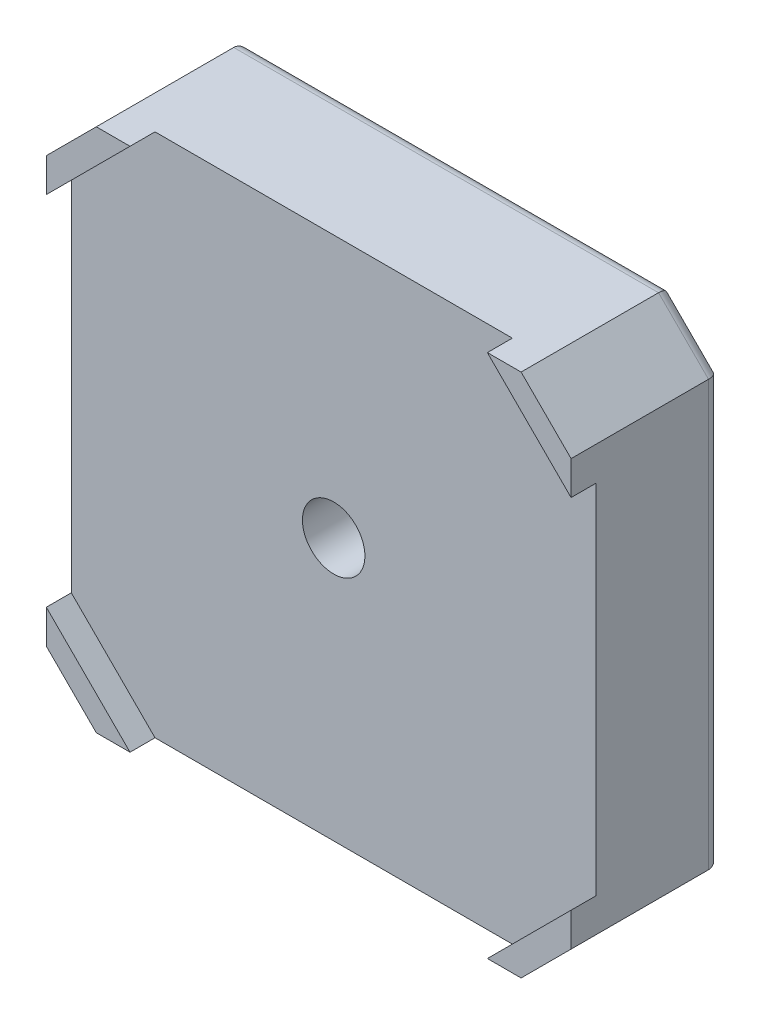
ISO-10303-21;
HEADER;
FILE_DESCRIPTION(('STEP AP214'),'2;1');
FILE_NAME('part.step','',(''),(''),'','','');
FILE_SCHEMA(('AUTOMOTIVE_DESIGN { 1 0 10303 214 1 1 1 1 }'));
ENDSEC;
DATA;
#1=APPLICATION_CONTEXT('core data for automotive mechanical design processes');
#2=APPLICATION_PROTOCOL_DEFINITION('international standard','automotive_design',2000,#1);
#3=PRODUCT_CONTEXT('',#1,'mechanical');
#4=PRODUCT('Part','Part','',(#3));
#5=PRODUCT_RELATED_PRODUCT_CATEGORY('part','',(#4));
#6=PRODUCT_DEFINITION_FORMATION('','',#4);
#7=PRODUCT_DEFINITION_CONTEXT('part definition',#1,'design');
#8=PRODUCT_DEFINITION('design','',#6,#7);
#9=PRODUCT_DEFINITION_SHAPE('','',#8);
#10=(LENGTH_UNIT() NAMED_UNIT(*) SI_UNIT(.MILLI.,.METRE.));
#11=(NAMED_UNIT(*) PLANE_ANGLE_UNIT() SI_UNIT($,.RADIAN.));
#12=(NAMED_UNIT(*) SI_UNIT($,.STERADIAN.) SOLID_ANGLE_UNIT());
#13=UNCERTAINTY_MEASURE_WITH_UNIT(LENGTH_MEASURE(1.E-05),#10,'distance_accuracy_value','');
#14=(GEOMETRIC_REPRESENTATION_CONTEXT(3) GLOBAL_UNCERTAINTY_ASSIGNED_CONTEXT((#13)) GLOBAL_UNIT_ASSIGNED_CONTEXT((#10,
#11,#12)) REPRESENTATION_CONTEXT('',''));
#15=CARTESIAN_POINT('',(0.,0.,0.));
#16=DIRECTION('',(0.,0.,1.));
#17=DIRECTION('',(1.,0.,0.));
#18=AXIS2_PLACEMENT_3D('',#15,#16,#17);
#19=CARTESIAN_POINT('',(0.,0.,12.));
#20=DIRECTION('',(0.,0.,-1.));
#21=DIRECTION('',(-1.,0.,0.));
#22=AXIS2_PLACEMENT_3D('',#19,#20,#21);
#23=PLANE('',#22);
#24=DIRECTION('',(0.,-1.,0.));
#25=VECTOR('',#24,1.);
#26=CARTESIAN_POINT('',(-21.,-17.,12.));
#27=LINE('',#26,#25);
#28=CARTESIAN_POINT('',(-21.,17.,12.));
#29=VERTEX_POINT('',#28);
#30=CARTESIAN_POINT('',(-21.,14.3,12.));
#31=VERTEX_POINT('',#30);
#32=EDGE_CURVE('E265',#29,#31,#27,.T.);
#33=ORIENTED_EDGE('',*,*,#32,.T.);
#34=DIRECTION('',(0.707106781186548,0.707106781186548,0.));
#35=VECTOR('',#34,1.);
#36=CARTESIAN_POINT('',(-17.65,17.65,12.));
#37=LINE('',#36,#35);
#38=CARTESIAN_POINT('',(-14.3,21.,12.));
#39=VERTEX_POINT('',#38);
#40=EDGE_CURVE('E318',#31,#39,#37,.T.);
#41=ORIENTED_EDGE('',*,*,#40,.T.);
#42=DIRECTION('',(-1.,0.,0.));
#43=VECTOR('',#42,1.);
#44=CARTESIAN_POINT('',(-17.,21.,12.));
#45=LINE('',#44,#43);
#46=CARTESIAN_POINT('',(-17.,21.,12.));
#47=VERTEX_POINT('',#46);
#48=EDGE_CURVE('E282',#39,#47,#45,.T.);
#49=ORIENTED_EDGE('',*,*,#48,.T.);
#50=DIRECTION('',(-0.707106781186548,-0.707106781186548,0.));
#51=VECTOR('',#50,1.);
#52=CARTESIAN_POINT('',(-21.,17.,12.));
#53=LINE('',#52,#51);
#54=EDGE_CURVE('E286',#47,#29,#53,.T.);
#55=ORIENTED_EDGE('',*,*,#54,.T.);
#56=EDGE_LOOP('',(#33,#41,#49,#55));
#57=FACE_BOUND('',#56,.T.);
#58=ADVANCED_FACE('F37',(#57),#23,.F.);
#59=CARTESIAN_POINT('',(17.,21.,12.));
#60=VERTEX_POINT('',#59);
#61=CARTESIAN_POINT('',(14.3,21.,12.));
#62=VERTEX_POINT('',#61);
#63=EDGE_CURVE('E283',#60,#62,#45,.T.);
#64=ORIENTED_EDGE('',*,*,#63,.T.);
#65=DIRECTION('',(0.707106781186548,-0.707106781186548,0.));
#66=VECTOR('',#65,1.);
#67=CARTESIAN_POINT('',(17.65,17.65,12.));
#68=LINE('',#67,#66);
#69=CARTESIAN_POINT('',(21.,14.3,12.));
#70=VERTEX_POINT('',#69);
#71=EDGE_CURVE('E315',#62,#70,#68,.T.);
#72=ORIENTED_EDGE('',*,*,#71,.T.);
#73=DIRECTION('',(0.,1.,0.));
#74=VECTOR('',#73,1.);
#75=CARTESIAN_POINT('',(21.,-17.,12.));
#76=LINE('',#75,#74);
#77=CARTESIAN_POINT('',(21.,17.,12.));
#78=VERTEX_POINT('',#77);
#79=EDGE_CURVE('E276',#70,#78,#76,.T.);
#80=ORIENTED_EDGE('',*,*,#79,.T.);
#81=DIRECTION('',(-0.707106781186548,0.707106781186548,0.));
#82=VECTOR('',#81,1.);
#83=CARTESIAN_POINT('',(17.,21.,12.));
#84=LINE('',#83,#82);
#85=EDGE_CURVE('E280',#78,#60,#84,.T.);
#86=ORIENTED_EDGE('',*,*,#85,.T.);
#87=EDGE_LOOP('',(#64,#72,#80,#86));
#88=FACE_BOUND('',#87,.T.);
#89=ADVANCED_FACE('F431',(#88),#23,.F.);
#90=CARTESIAN_POINT('',(21.,-17.,12.));
#91=VERTEX_POINT('',#90);
#92=CARTESIAN_POINT('',(21.,-14.3,12.));
#93=VERTEX_POINT('',#92);
#94=EDGE_CURVE('E277',#91,#93,#76,.T.);
#95=ORIENTED_EDGE('',*,*,#94,.T.);
#96=DIRECTION('',(-0.707106781186548,-0.707106781186548,0.));
#97=VECTOR('',#96,1.);
#98=CARTESIAN_POINT('',(17.65,-17.65,12.));
#99=LINE('',#98,#97);
#100=CARTESIAN_POINT('',(14.3,-21.,12.));
#101=VERTEX_POINT('',#100);
#102=EDGE_CURVE('E312',#93,#101,#99,.T.);
#103=ORIENTED_EDGE('',*,*,#102,.T.);
#104=DIRECTION('',(1.,0.,0.));
#105=VECTOR('',#104,1.);
#106=CARTESIAN_POINT('',(-17.,-21.,12.));
#107=LINE('',#106,#105);
#108=CARTESIAN_POINT('',(17.,-21.,12.));
#109=VERTEX_POINT('',#108);
#110=EDGE_CURVE('E270',#101,#109,#107,.T.);
#111=ORIENTED_EDGE('',*,*,#110,.T.);
#112=DIRECTION('',(0.707106781186547,0.707106781186548,0.));
#113=VECTOR('',#112,1.);
#114=CARTESIAN_POINT('',(17.,-21.,12.));
#115=LINE('',#114,#113);
#116=EDGE_CURVE('E274',#109,#91,#115,.T.);
#117=ORIENTED_EDGE('',*,*,#116,.T.);
#118=EDGE_LOOP('',(#95,#103,#111,#117));
#119=FACE_BOUND('',#118,.T.);
#120=ADVANCED_FACE('F438',(#119),#23,.F.);
#121=CARTESIAN_POINT('',(-21.,-17.,12.));
#122=DIRECTION('',(1.,0.,0.));
#123=DIRECTION('',(0.,0.,-1.));
#124=AXIS2_PLACEMENT_3D('',#121,#122,#123);
#125=PLANE('',#124);
#126=DIRECTION('',(0.,0.,-1.));
#127=VECTOR('',#126,1.);
#128=CARTESIAN_POINT('',(-21.,17.,12.));
#129=LINE('',#128,#127);
#130=CARTESIAN_POINT('',(-21.,17.,1.));
#131=VERTEX_POINT('',#130);
#132=EDGE_CURVE('E288',#29,#131,#129,.T.);
#133=ORIENTED_EDGE('',*,*,#132,.T.);
#134=DIRECTION('',(0.,-1.,0.));
#135=VECTOR('',#134,1.);
#136=CARTESIAN_POINT('',(-21.,-17.,1.));
#137=LINE('',#136,#135);
#138=CARTESIAN_POINT('',(-21.,-17.,1.));
#139=VERTEX_POINT('',#138);
#140=EDGE_CURVE('E344',#131,#139,#137,.T.);
#141=ORIENTED_EDGE('',*,*,#140,.T.);
#142=DIRECTION('',(0.,0.,-1.));
#143=VECTOR('',#142,1.);
#144=CARTESIAN_POINT('',(-21.,-17.,12.));
#145=LINE('',#144,#143);
#146=CARTESIAN_POINT('',(-21.,-17.,12.));
#147=VERTEX_POINT('',#146);
#148=EDGE_CURVE('E306',#147,#139,#145,.T.);
#149=ORIENTED_EDGE('',*,*,#148,.F.);
#150=CARTESIAN_POINT('',(-21.,-14.3,12.));
#151=VERTEX_POINT('',#150);
#152=EDGE_CURVE('E264',#151,#147,#27,.T.);
#153=ORIENTED_EDGE('',*,*,#152,.F.);
#154=DIRECTION('',(0.,0.,-1.));
#155=VECTOR('',#154,1.);
#156=CARTESIAN_POINT('',(-21.,-14.3,12.));
#157=LINE('',#156,#155);
#158=CARTESIAN_POINT('',(-21.,-14.3,10.));
#159=VERTEX_POINT('',#158);
#160=EDGE_CURVE('E234',#151,#159,#157,.T.);
#161=ORIENTED_EDGE('',*,*,#160,.T.);
#162=DIRECTION('',(0.,1.,0.));
#163=VECTOR('',#162,1.);
#164=CARTESIAN_POINT('',(-21.,-17.,10.));
#165=LINE('',#164,#163);
#166=CARTESIAN_POINT('',(-21.,14.3,10.));
#167=VERTEX_POINT('',#166);
#168=EDGE_CURVE('E261',#159,#167,#165,.T.);
#169=ORIENTED_EDGE('',*,*,#168,.T.);
#170=DIRECTION('',(0.,0.,1.));
#171=VECTOR('',#170,1.);
#172=CARTESIAN_POINT('',(-21.,14.3,12.));
#173=LINE('',#172,#171);
#174=EDGE_CURVE('E252',#167,#31,#173,.T.);
#175=ORIENTED_EDGE('',*,*,#174,.T.);
#176=ORIENTED_EDGE('',*,*,#32,.F.);
#177=EDGE_LOOP('',(#133,#141,#149,#153,#161,#169,#175,#176));
#178=FACE_BOUND('',#177,.T.);
#179=ADVANCED_FACE('F457',(#178),#125,.F.);
#180=CARTESIAN_POINT('',(-21.,-17.,12.));
#181=DIRECTION('',(0.707106781186547,0.707106781186547,0.));
#182=DIRECTION('',(-0.707106781186548,0.707106781186548,0.));
#183=AXIS2_PLACEMENT_3D('',#180,#181,#182);
#184=PLANE('',#183);
#185=ORIENTED_EDGE('',*,*,#148,.T.);
#186=DIRECTION('',(0.707106781186548,-0.707106781186548,0.));
#187=VECTOR('',#186,1.);
#188=CARTESIAN_POINT('',(-17.,-21.,1.));
#189=LINE('',#188,#187);
#190=CARTESIAN_POINT('',(-17.,-21.,1.));
#191=VERTEX_POINT('',#190);
#192=EDGE_CURVE('E346',#139,#191,#189,.T.);
#193=ORIENTED_EDGE('',*,*,#192,.T.);
#194=DIRECTION('',(0.,0.,-1.));
#195=VECTOR('',#194,1.);
#196=CARTESIAN_POINT('',(-17.,-21.,12.));
#197=LINE('',#196,#195);
#198=CARTESIAN_POINT('',(-17.,-21.,12.));
#199=VERTEX_POINT('',#198);
#200=EDGE_CURVE('E303',#199,#191,#197,.T.);
#201=ORIENTED_EDGE('',*,*,#200,.F.);
#202=DIRECTION('',(0.707106781186548,-0.707106781186548,0.));
#203=VECTOR('',#202,1.);
#204=CARTESIAN_POINT('',(-21.,-17.,12.));
#205=LINE('',#204,#203);
#206=EDGE_CURVE('E268',#147,#199,#205,.T.);
#207=ORIENTED_EDGE('',*,*,#206,.F.);
#208=EDGE_LOOP('',(#185,#193,#201,#207));
#209=FACE_BOUND('',#208,.T.);
#210=ADVANCED_FACE('F462',(#209),#184,.F.);
#211=CARTESIAN_POINT('',(-17.,-21.,12.));
#212=DIRECTION('',(0.,1.,0.));
#213=DIRECTION('',(0.,0.,1.));
#214=AXIS2_PLACEMENT_3D('',#211,#212,#213);
#215=PLANE('',#214);
#216=ORIENTED_EDGE('',*,*,#200,.T.);
#217=DIRECTION('',(1.,0.,0.));
#218=VECTOR('',#217,1.);
#219=CARTESIAN_POINT('',(17.,-21.,1.));
#220=LINE('',#219,#218);
#221=CARTESIAN_POINT('',(17.,-21.,1.));
#222=VERTEX_POINT('',#221);
#223=EDGE_CURVE('E348',#191,#222,#220,.T.);
#224=ORIENTED_EDGE('',*,*,#223,.T.);
#225=DIRECTION('',(0.,0.,-1.));
#226=VECTOR('',#225,1.);
#227=CARTESIAN_POINT('',(17.,-21.,12.));
#228=LINE('',#227,#226);
#229=EDGE_CURVE('E300',#109,#222,#228,.T.);
#230=ORIENTED_EDGE('',*,*,#229,.F.);
#231=ORIENTED_EDGE('',*,*,#110,.F.);
#232=DIRECTION('',(0.,0.,-1.));
#233=VECTOR('',#232,1.);
#234=CARTESIAN_POINT('',(14.3,-21.,12.));
#235=LINE('',#234,#233);
#236=CARTESIAN_POINT('',(14.3,-21.,10.));
#237=VERTEX_POINT('',#236);
#238=EDGE_CURVE('E240',#101,#237,#235,.T.);
#239=ORIENTED_EDGE('',*,*,#238,.T.);
#240=DIRECTION('',(-1.,0.,0.));
#241=VECTOR('',#240,1.);
#242=CARTESIAN_POINT('',(-17.,-21.,10.));
#243=LINE('',#242,#241);
#244=CARTESIAN_POINT('',(-14.3,-21.,10.));
#245=VERTEX_POINT('',#244);
#246=EDGE_CURVE('E258',#237,#245,#243,.T.);
#247=ORIENTED_EDGE('',*,*,#246,.T.);
#248=DIRECTION('',(0.,0.,1.));
#249=VECTOR('',#248,1.);
#250=CARTESIAN_POINT('',(-14.3,-21.,12.));
#251=LINE('',#250,#249);
#252=CARTESIAN_POINT('',(-14.3,-21.,12.));
#253=VERTEX_POINT('',#252);
#254=EDGE_CURVE('E231',#245,#253,#251,.T.);
#255=ORIENTED_EDGE('',*,*,#254,.T.);
#256=EDGE_CURVE('E271',#199,#253,#107,.T.);
#257=ORIENTED_EDGE('',*,*,#256,.F.);
#258=EDGE_LOOP('',(#216,#224,#230,#231,#239,#247,#255,#257));
#259=FACE_BOUND('',#258,.T.);
#260=ADVANCED_FACE('F478',(#259),#215,.F.);
#261=CARTESIAN_POINT('',(17.,-21.,12.));
#262=DIRECTION('',(-0.707106781186548,0.707106781186547,0.));
#263=DIRECTION('',(-0.707106781186547,-0.707106781186548,0.));
#264=AXIS2_PLACEMENT_3D('',#261,#262,#263);
#265=PLANE('',#264);
#266=ORIENTED_EDGE('',*,*,#229,.T.);
#267=DIRECTION('',(0.707106781186547,0.707106781186548,0.));
#268=VECTOR('',#267,1.);
#269=CARTESIAN_POINT('',(21.,-17.,1.));
#270=LINE('',#269,#268);
#271=CARTESIAN_POINT('',(21.,-17.,1.));
#272=VERTEX_POINT('',#271);
#273=EDGE_CURVE('E350',#222,#272,#270,.T.);
#274=ORIENTED_EDGE('',*,*,#273,.T.);
#275=DIRECTION('',(0.,0.,-1.));
#276=VECTOR('',#275,1.);
#277=CARTESIAN_POINT('',(21.,-17.,12.));
#278=LINE('',#277,#276);
#279=EDGE_CURVE('E298',#91,#272,#278,.T.);
#280=ORIENTED_EDGE('',*,*,#279,.F.);
#281=ORIENTED_EDGE('',*,*,#116,.F.);
#282=EDGE_LOOP('',(#266,#274,#280,#281));
#283=FACE_BOUND('',#282,.T.);
#284=ADVANCED_FACE('F484',(#283),#265,.F.);
#285=CARTESIAN_POINT('',(21.,-17.,12.));
#286=DIRECTION('',(-1.,0.,0.));
#287=DIRECTION('',(0.,-1.,0.));
#288=AXIS2_PLACEMENT_3D('',#285,#286,#287);
#289=PLANE('',#288);
#290=ORIENTED_EDGE('',*,*,#279,.T.);
#291=DIRECTION('',(0.,1.,0.));
#292=VECTOR('',#291,1.);
#293=CARTESIAN_POINT('',(21.,17.,1.));
#294=LINE('',#293,#292);
#295=CARTESIAN_POINT('',(21.,17.,1.));
#296=VERTEX_POINT('',#295);
#297=EDGE_CURVE('E60',#272,#296,#294,.T.);
#298=ORIENTED_EDGE('',*,*,#297,.T.);
#299=DIRECTION('',(0.,0.,-1.));
#300=VECTOR('',#299,1.);
#301=CARTESIAN_POINT('',(21.,17.,12.));
#302=LINE('',#301,#300);
#303=EDGE_CURVE('E296',#78,#296,#302,.T.);
#304=ORIENTED_EDGE('',*,*,#303,.F.);
#305=ORIENTED_EDGE('',*,*,#79,.F.);
#306=DIRECTION('',(0.,0.,-1.));
#307=VECTOR('',#306,1.);
#308=CARTESIAN_POINT('',(21.,14.3,12.));
#309=LINE('',#308,#307);
#310=CARTESIAN_POINT('',(21.,14.3,10.));
#311=VERTEX_POINT('',#310);
#312=EDGE_CURVE('E246',#70,#311,#309,.T.);
#313=ORIENTED_EDGE('',*,*,#312,.T.);
#314=DIRECTION('',(0.,-1.,0.));
#315=VECTOR('',#314,1.);
#316=CARTESIAN_POINT('',(21.,-17.,10.));
#317=LINE('',#316,#315);
#318=CARTESIAN_POINT('',(21.,-14.3,10.));
#319=VERTEX_POINT('',#318);
#320=EDGE_CURVE('E255',#311,#319,#317,.T.);
#321=ORIENTED_EDGE('',*,*,#320,.T.);
#322=DIRECTION('',(0.,0.,1.));
#323=VECTOR('',#322,1.);
#324=CARTESIAN_POINT('',(21.,-14.3,12.));
#325=LINE('',#324,#323);
#326=EDGE_CURVE('E237',#319,#93,#325,.T.);
#327=ORIENTED_EDGE('',*,*,#326,.T.);
#328=ORIENTED_EDGE('',*,*,#94,.F.);
#329=EDGE_LOOP('',(#290,#298,#304,#305,#313,#321,#327,#328));
#330=FACE_BOUND('',#329,.T.);
#331=ADVANCED_FACE('F469',(#330),#289,.F.);
#332=CARTESIAN_POINT('',(17.,21.,12.));
#333=DIRECTION('',(-0.707106781186547,-0.707106781186547,0.));
#334=DIRECTION('',(0.707106781186548,-0.707106781186548,0.));
#335=AXIS2_PLACEMENT_3D('',#332,#333,#334);
#336=PLANE('',#335);
#337=ORIENTED_EDGE('',*,*,#303,.T.);
#338=DIRECTION('',(-0.707106781186548,0.707106781186548,0.));
#339=VECTOR('',#338,1.);
#340=CARTESIAN_POINT('',(17.,21.,1.));
#341=LINE('',#340,#339);
#342=CARTESIAN_POINT('',(17.,21.,1.));
#343=VERTEX_POINT('',#342);
#344=EDGE_CURVE('E52',#296,#343,#341,.T.);
#345=ORIENTED_EDGE('',*,*,#344,.T.);
#346=DIRECTION('',(0.,0.,-1.));
#347=VECTOR('',#346,1.);
#348=CARTESIAN_POINT('',(17.,21.,12.));
#349=LINE('',#348,#347);
#350=EDGE_CURVE('E294',#60,#343,#349,.T.);
#351=ORIENTED_EDGE('',*,*,#350,.F.);
#352=ORIENTED_EDGE('',*,*,#85,.F.);
#353=EDGE_LOOP('',(#337,#345,#351,#352));
#354=FACE_BOUND('',#353,.T.);
#355=ADVANCED_FACE('F901',(#354),#336,.F.);
#356=CARTESIAN_POINT('',(-17.,21.,12.));
#357=DIRECTION('',(0.,-1.,0.));
#358=DIRECTION('',(1.,0.,0.));
#359=AXIS2_PLACEMENT_3D('',#356,#357,#358);
#360=PLANE('',#359);
#361=ORIENTED_EDGE('',*,*,#350,.T.);
#362=DIRECTION('',(-1.,0.,0.));
#363=VECTOR('',#362,1.);
#364=CARTESIAN_POINT('',(-17.,21.,1.));
#365=LINE('',#364,#363);
#366=CARTESIAN_POINT('',(-17.,21.,1.));
#367=VERTEX_POINT('',#366);
#368=EDGE_CURVE('E354',#343,#367,#365,.T.);
#369=ORIENTED_EDGE('',*,*,#368,.T.);
#370=DIRECTION('',(0.,0.,-1.));
#371=VECTOR('',#370,1.);
#372=CARTESIAN_POINT('',(-17.,21.,12.));
#373=LINE('',#372,#371);
#374=EDGE_CURVE('E291',#47,#367,#373,.T.);
#375=ORIENTED_EDGE('',*,*,#374,.F.);
#376=ORIENTED_EDGE('',*,*,#48,.F.);
#377=DIRECTION('',(0.,0.,-1.));
#378=VECTOR('',#377,1.);
#379=CARTESIAN_POINT('',(-14.3,21.,12.));
#380=LINE('',#379,#378);
#381=CARTESIAN_POINT('',(-14.3,21.,10.));
#382=VERTEX_POINT('',#381);
#383=EDGE_CURVE('E249',#39,#382,#380,.T.);
#384=ORIENTED_EDGE('',*,*,#383,.T.);
#385=DIRECTION('',(1.,0.,0.));
#386=VECTOR('',#385,1.);
#387=CARTESIAN_POINT('',(-17.,21.,10.));
#388=LINE('',#387,#386);
#389=CARTESIAN_POINT('',(14.3,21.,10.));
#390=VERTEX_POINT('',#389);
#391=EDGE_CURVE('E218',#382,#390,#388,.T.);
#392=ORIENTED_EDGE('',*,*,#391,.T.);
#393=DIRECTION('',(0.,0.,1.));
#394=VECTOR('',#393,1.);
#395=CARTESIAN_POINT('',(14.3,21.,12.));
#396=LINE('',#395,#394);
#397=EDGE_CURVE('E243',#390,#62,#396,.T.);
#398=ORIENTED_EDGE('',*,*,#397,.T.);
#399=ORIENTED_EDGE('',*,*,#63,.F.);
#400=EDGE_LOOP('',(#361,#369,#375,#376,#384,#392,#398,#399));
#401=FACE_BOUND('',#400,.T.);
#402=ADVANCED_FACE('F453',(#401),#360,.F.);
#403=CARTESIAN_POINT('',(-21.,17.,12.));
#404=DIRECTION('',(0.707106781186547,-0.707106781186547,0.));
#405=DIRECTION('',(0.707106781186548,0.707106781186548,0.));
#406=AXIS2_PLACEMENT_3D('',#403,#404,#405);
#407=PLANE('',#406);
#408=ORIENTED_EDGE('',*,*,#374,.T.);
#409=DIRECTION('',(-0.707106781186548,-0.707106781186548,0.));
#410=VECTOR('',#409,1.);
#411=CARTESIAN_POINT('',(-21.,17.,1.));
#412=LINE('',#411,#410);
#413=EDGE_CURVE('E217',#367,#131,#412,.T.);
#414=ORIENTED_EDGE('',*,*,#413,.T.);
#415=ORIENTED_EDGE('',*,*,#132,.F.);
#416=ORIENTED_EDGE('',*,*,#54,.F.);
#417=EDGE_LOOP('',(#408,#414,#415,#416));
#418=FACE_BOUND('',#417,.T.);
#419=ADVANCED_FACE('F444',(#418),#407,.F.);
#420=ORIENTED_EDGE('',*,*,#256,.T.);
#421=DIRECTION('',(-0.707106781186548,0.707106781186548,0.));
#422=VECTOR('',#421,1.);
#423=CARTESIAN_POINT('',(-17.65,-17.65,12.));
#424=LINE('',#423,#422);
#425=EDGE_CURVE('E309',#253,#151,#424,.T.);
#426=ORIENTED_EDGE('',*,*,#425,.T.);
#427=ORIENTED_EDGE('',*,*,#152,.T.);
#428=ORIENTED_EDGE('',*,*,#206,.T.);
#429=EDGE_LOOP('',(#420,#426,#427,#428));
#430=FACE_BOUND('',#429,.T.);
#431=ADVANCED_FACE('F434',(#430),#23,.F.);
#432=CARTESIAN_POINT('',(0.,0.,0.));
#433=DIRECTION('',(0.,0.,-1.));
#434=DIRECTION('',(-1.,0.,0.));
#435=AXIS2_PLACEMENT_3D('',#432,#433,#434);
#436=PLANE('',#435);
#437=CARTESIAN_POINT('',(15.5,-15.5,0.));
#438=DIRECTION('',(0.,0.,-1.));
#439=DIRECTION('',(-1.,0.,0.));
#440=AXIS2_PLACEMENT_3D('',#437,#438,#439);
#441=CIRCLE('',#440,1.5);
#442=CARTESIAN_POINT('',(14.,-15.5,0.));
#443=VERTEX_POINT('',#442);
#444=EDGE_CURVE('E406',#443,#443,#441,.F.);
#445=ORIENTED_EDGE('',*,*,#444,.T.);
#446=EDGE_LOOP('',(#445));
#447=FACE_BOUND('',#446,.T.);
#448=CARTESIAN_POINT('',(-15.5,-15.5,0.));
#449=DIRECTION('',(0.,0.,-1.));
#450=DIRECTION('',(-1.,0.,0.));
#451=AXIS2_PLACEMENT_3D('',#448,#449,#450);
#452=CIRCLE('',#451,1.5);
#453=CARTESIAN_POINT('',(-17.,-15.5,0.));
#454=VERTEX_POINT('',#453);
#455=EDGE_CURVE('E403',#454,#454,#452,.F.);
#456=ORIENTED_EDGE('',*,*,#455,.T.);
#457=EDGE_LOOP('',(#456));
#458=FACE_BOUND('',#457,.T.);
#459=CARTESIAN_POINT('',(-15.5,15.5,0.));
#460=DIRECTION('',(0.,0.,-1.));
#461=DIRECTION('',(-1.,0.,0.));
#462=AXIS2_PLACEMENT_3D('',#459,#460,#461);
#463=CIRCLE('',#462,1.5);
#464=CARTESIAN_POINT('',(-17.,15.5,0.));
#465=VERTEX_POINT('',#464);
#466=EDGE_CURVE('E400',#465,#465,#463,.F.);
#467=ORIENTED_EDGE('',*,*,#466,.T.);
#468=EDGE_LOOP('',(#467));
#469=FACE_BOUND('',#468,.T.);
#470=CARTESIAN_POINT('',(15.5,15.5,0.));
#471=DIRECTION('',(0.,0.,-1.));
#472=DIRECTION('',(-1.,0.,0.));
#473=AXIS2_PLACEMENT_3D('',#470,#471,#472);
#474=CIRCLE('',#473,1.5);
#475=CARTESIAN_POINT('',(14.,15.5,0.));
#476=VERTEX_POINT('',#475);
#477=EDGE_CURVE('E397',#476,#476,#474,.F.);
#478=ORIENTED_EDGE('',*,*,#477,.T.);
#479=EDGE_LOOP('',(#478));
#480=FACE_BOUND('',#479,.T.);
#481=DIRECTION('',(0.,-1.,0.));
#482=VECTOR('',#481,1.);
#483=CARTESIAN_POINT('',(-20.,17.,0.));
#484=LINE('',#483,#482);
#485=CARTESIAN_POINT('',(-20.,-16.5857864376269,0.));
#486=VERTEX_POINT('',#485);
#487=CARTESIAN_POINT('',(-20.,16.5857864376269,0.));
#488=VERTEX_POINT('',#487);
#489=EDGE_CURVE('E339',#486,#488,#484,.F.);
#490=ORIENTED_EDGE('',*,*,#489,.T.);
#491=DIRECTION('',(-0.707106781186548,-0.707106781186548,0.));
#492=VECTOR('',#491,1.);
#493=CARTESIAN_POINT('',(-16.2928932188135,20.2928932188135,0.));
#494=LINE('',#493,#492);
#495=CARTESIAN_POINT('',(-16.5857864376269,20.,0.));
#496=VERTEX_POINT('',#495);
#497=EDGE_CURVE('E341',#488,#496,#494,.F.);
#498=ORIENTED_EDGE('',*,*,#497,.T.);
#499=DIRECTION('',(-1.,0.,0.));
#500=VECTOR('',#499,1.);
#501=CARTESIAN_POINT('',(17.,20.,0.));
#502=LINE('',#501,#500);
#503=CARTESIAN_POINT('',(16.5857864376269,20.,0.));
#504=VERTEX_POINT('',#503);
#505=EDGE_CURVE('E327',#496,#504,#502,.F.);
#506=ORIENTED_EDGE('',*,*,#505,.T.);
#507=DIRECTION('',(-0.707106781186548,0.707106781186548,0.));
#508=VECTOR('',#507,1.);
#509=CARTESIAN_POINT('',(20.2928932188135,16.2928932188135,0.));
#510=LINE('',#509,#508);
#511=CARTESIAN_POINT('',(20.,16.5857864376269,0.));
#512=VERTEX_POINT('',#511);
#513=EDGE_CURVE('E329',#504,#512,#510,.F.);
#514=ORIENTED_EDGE('',*,*,#513,.T.);
#515=DIRECTION('',(0.,1.,0.));
#516=VECTOR('',#515,1.);
#517=CARTESIAN_POINT('',(20.,-17.,0.));
#518=LINE('',#517,#516);
#519=CARTESIAN_POINT('',(20.,-16.5857864376269,0.));
#520=VERTEX_POINT('',#519);
#521=EDGE_CURVE('E331',#512,#520,#518,.F.);
#522=ORIENTED_EDGE('',*,*,#521,.T.);
#523=DIRECTION('',(0.707106781186547,0.707106781186548,0.));
#524=VECTOR('',#523,1.);
#525=CARTESIAN_POINT('',(16.2928932188135,-20.2928932188135,0.));
#526=LINE('',#525,#524);
#527=CARTESIAN_POINT('',(16.5857864376269,-20.,0.));
#528=VERTEX_POINT('',#527);
#529=EDGE_CURVE('E333',#520,#528,#526,.F.);
#530=ORIENTED_EDGE('',*,*,#529,.T.);
#531=DIRECTION('',(1.,0.,0.));
#532=VECTOR('',#531,1.);
#533=CARTESIAN_POINT('',(-17.,-20.,0.));
#534=LINE('',#533,#532);
#535=CARTESIAN_POINT('',(-16.5857864376269,-20.,0.));
#536=VERTEX_POINT('',#535);
#537=EDGE_CURVE('E335',#528,#536,#534,.F.);
#538=ORIENTED_EDGE('',*,*,#537,.T.);
#539=DIRECTION('',(0.707106781186548,-0.707106781186548,0.));
#540=VECTOR('',#539,1.);
#541=CARTESIAN_POINT('',(-20.2928932188135,-16.2928932188135,0.));
#542=LINE('',#541,#540);
#543=EDGE_CURVE('E337',#536,#486,#542,.F.);
#544=ORIENTED_EDGE('',*,*,#543,.T.);
#545=EDGE_LOOP('',(#490,#498,#506,#514,#522,#530,#538,#544));
#546=FACE_BOUND('',#545,.T.);
#547=CARTESIAN_POINT('',(0.,0.,0.));
#548=DIRECTION('',(0.,0.,-1.));
#549=DIRECTION('',(-1.,0.,0.));
#550=AXIS2_PLACEMENT_3D('',#547,#548,#549);
#551=CIRCLE('',#550,11.);
#552=CARTESIAN_POINT('',(-11.,0.,0.));
#553=VERTEX_POINT('',#552);
#554=EDGE_CURVE('E214',#553,#553,#551,.T.);
#555=ORIENTED_EDGE('',*,*,#554,.F.);
#556=EDGE_LOOP('',(#555));
#557=FACE_BOUND('',#556,.T.);
#558=ADVANCED_FACE('F443',(#447,#458,#469,#480,#546,#557),#436,.T.);
#559=CARTESIAN_POINT('',(0.,0.,10.));
#560=DIRECTION('',(0.,0.,-1.));
#561=DIRECTION('',(-1.,0.,0.));
#562=AXIS2_PLACEMENT_3D('',#559,#560,#561);
#563=PLANE('',#562);
#564=CARTESIAN_POINT('',(0.,0.,10.));
#565=DIRECTION('',(0.,0.,-1.));
#566=DIRECTION('',(-1.,0.,0.));
#567=AXIS2_PLACEMENT_3D('',#564,#565,#566);
#568=CIRCLE('',#567,2.5);
#569=CARTESIAN_POINT('',(-2.5,0.,10.));
#570=VERTEX_POINT('',#569);
#571=EDGE_CURVE('E212',#570,#570,#568,.T.);
#572=ORIENTED_EDGE('',*,*,#571,.T.);
#573=EDGE_LOOP('',(#572));
#574=FACE_BOUND('',#573,.T.);
#575=DIRECTION('',(0.707106781186547,-0.707106781186547,0.));
#576=VECTOR('',#575,1.);
#577=CARTESIAN_POINT('',(-21.15,-14.15,10.));
#578=LINE('',#577,#576);
#579=EDGE_CURVE('E219',#159,#245,#578,.T.);
#580=ORIENTED_EDGE('',*,*,#579,.T.);
#581=ORIENTED_EDGE('',*,*,#246,.F.);
#582=DIRECTION('',(0.707106781186547,0.707106781186547,0.));
#583=VECTOR('',#582,1.);
#584=CARTESIAN_POINT('',(14.15,-21.15,10.));
#585=LINE('',#584,#583);
#586=EDGE_CURVE('E222',#237,#319,#585,.T.);
#587=ORIENTED_EDGE('',*,*,#586,.T.);
#588=ORIENTED_EDGE('',*,*,#320,.F.);
#589=DIRECTION('',(-0.707106781186547,0.707106781186547,0.));
#590=VECTOR('',#589,1.);
#591=CARTESIAN_POINT('',(14.15,21.15,10.));
#592=LINE('',#591,#590);
#593=EDGE_CURVE('E225',#311,#390,#592,.T.);
#594=ORIENTED_EDGE('',*,*,#593,.T.);
#595=ORIENTED_EDGE('',*,*,#391,.F.);
#596=DIRECTION('',(-0.707106781186547,-0.707106781186547,0.));
#597=VECTOR('',#596,1.);
#598=CARTESIAN_POINT('',(-21.15,14.15,10.));
#599=LINE('',#598,#597);
#600=EDGE_CURVE('E228',#382,#167,#599,.T.);
#601=ORIENTED_EDGE('',*,*,#600,.T.);
#602=ORIENTED_EDGE('',*,*,#168,.F.);
#603=EDGE_LOOP('',(#580,#581,#587,#588,#594,#595,#601,#602));
#604=FACE_BOUND('',#603,.T.);
#605=ADVANCED_FACE('F451',(#574,#604),#563,.F.);
#606=CARTESIAN_POINT('',(-21.15,14.15,10.));
#607=DIRECTION('',(-0.707106781186547,0.707106781186547,0.));
#608=DIRECTION('',(-0.707106781186548,-0.707106781186548,0.));
#609=AXIS2_PLACEMENT_3D('',#606,#607,#608);
#610=PLANE('',#609);
#611=ORIENTED_EDGE('',*,*,#600,.F.);
#612=ORIENTED_EDGE('',*,*,#383,.F.);
#613=ORIENTED_EDGE('',*,*,#40,.F.);
#614=ORIENTED_EDGE('',*,*,#174,.F.);
#615=EDGE_LOOP('',(#611,#612,#613,#614));
#616=FACE_BOUND('',#615,.T.);
#617=ADVANCED_FACE('F520',(#616),#610,.F.);
#618=CARTESIAN_POINT('',(14.15,21.15,10.));
#619=DIRECTION('',(0.707106781186547,0.707106781186547,0.));
#620=DIRECTION('',(-0.707106781186548,0.707106781186548,0.));
#621=AXIS2_PLACEMENT_3D('',#618,#619,#620);
#622=PLANE('',#621);
#623=ORIENTED_EDGE('',*,*,#71,.F.);
#624=ORIENTED_EDGE('',*,*,#397,.F.);
#625=ORIENTED_EDGE('',*,*,#593,.F.);
#626=ORIENTED_EDGE('',*,*,#312,.F.);
#627=EDGE_LOOP('',(#623,#624,#625,#626));
#628=FACE_BOUND('',#627,.T.);
#629=ADVANCED_FACE('F638',(#628),#622,.F.);
#630=CARTESIAN_POINT('',(14.15,-21.15,10.));
#631=DIRECTION('',(0.707106781186547,-0.707106781186547,0.));
#632=DIRECTION('',(0.707106781186548,0.707106781186548,0.));
#633=AXIS2_PLACEMENT_3D('',#630,#631,#632);
#634=PLANE('',#633);
#635=ORIENTED_EDGE('',*,*,#102,.F.);
#636=ORIENTED_EDGE('',*,*,#326,.F.);
#637=ORIENTED_EDGE('',*,*,#586,.F.);
#638=ORIENTED_EDGE('',*,*,#238,.F.);
#639=EDGE_LOOP('',(#635,#636,#637,#638));
#640=FACE_BOUND('',#639,.T.);
#641=ADVANCED_FACE('F473',(#640),#634,.F.);
#642=CARTESIAN_POINT('',(-21.15,-14.15,10.));
#643=DIRECTION('',(-0.707106781186547,-0.707106781186547,0.));
#644=DIRECTION('',(0.707106781186548,-0.707106781186548,0.));
#645=AXIS2_PLACEMENT_3D('',#642,#643,#644);
#646=PLANE('',#645);
#647=ORIENTED_EDGE('',*,*,#425,.F.);
#648=ORIENTED_EDGE('',*,*,#254,.F.);
#649=ORIENTED_EDGE('',*,*,#579,.F.);
#650=ORIENTED_EDGE('',*,*,#160,.F.);
#651=EDGE_LOOP('',(#647,#648,#649,#650));
#652=FACE_BOUND('',#651,.T.);
#653=ADVANCED_FACE('F524',(#652),#646,.F.);
#654=CARTESIAN_POINT('',(0.,0.,-2.));
#655=DIRECTION('',(0.,0.,1.));
#656=DIRECTION('',(1.,0.,0.));
#657=AXIS2_PLACEMENT_3D('',#654,#655,#656);
#658=CYLINDRICAL_SURFACE('',#657,11.);
#659=CARTESIAN_POINT('',(0.,0.,-1.5));
#660=DIRECTION('',(0.,0.,-1.));
#661=DIRECTION('',(-1.,0.,0.));
#662=AXIS2_PLACEMENT_3D('',#659,#660,#661);
#663=CIRCLE('',#662,11.);
#664=CARTESIAN_POINT('',(-11.,0.,-1.5));
#665=VERTEX_POINT('',#664);
#666=EDGE_CURVE('E382',#665,#665,#663,.F.);
#667=ORIENTED_EDGE('',*,*,#666,.T.);
#668=EDGE_LOOP('',(#667));
#669=FACE_BOUND('',#668,.T.);
#670=ORIENTED_EDGE('',*,*,#554,.T.);
#671=EDGE_LOOP('',(#670));
#672=FACE_BOUND('',#671,.T.);
#673=ADVANCED_FACE('F628',(#669,#672),#658,.T.);
#674=CARTESIAN_POINT('',(0.,0.,-2.));
#675=DIRECTION('',(0.,0.,-1.));
#676=DIRECTION('',(-1.,0.,0.));
#677=AXIS2_PLACEMENT_3D('',#674,#675,#676);
#678=PLANE('',#677);
#679=CARTESIAN_POINT('',(0.,0.,-2.));
#680=DIRECTION('',(0.,0.,-1.));
#681=DIRECTION('',(-1.,0.,0.));
#682=AXIS2_PLACEMENT_3D('',#679,#680,#681);
#683=CIRCLE('',#682,10.5);
#684=CARTESIAN_POINT('',(-10.5,0.,-2.));
#685=VERTEX_POINT('',#684);
#686=EDGE_CURVE('E379',#685,#685,#683,.T.);
#687=ORIENTED_EDGE('',*,*,#686,.T.);
#688=EDGE_LOOP('',(#687));
#689=FACE_BOUND('',#688,.T.);
#690=CARTESIAN_POINT('',(0.,0.,-2.));
#691=DIRECTION('',(0.,0.,-1.));
#692=DIRECTION('',(-1.,0.,0.));
#693=AXIS2_PLACEMENT_3D('',#690,#691,#692);
#694=CIRCLE('',#693,6.);
#695=CARTESIAN_POINT('',(-6.,0.,-2.));
#696=VERTEX_POINT('',#695);
#697=EDGE_CURVE('E356',#696,#696,#694,.F.);
#698=ORIENTED_EDGE('',*,*,#697,.T.);
#699=EDGE_LOOP('',(#698));
#700=FACE_BOUND('',#699,.T.);
#701=ADVANCED_FACE('F624',(#689,#700),#678,.T.);
#702=CARTESIAN_POINT('',(0.,0.,5.));
#703=DIRECTION('',(0.,0.,-1.));
#704=DIRECTION('',(-1.,0.,0.));
#705=AXIS2_PLACEMENT_3D('',#702,#703,#704);
#706=CYLINDRICAL_SURFACE('',#705,5.5);
#707=CARTESIAN_POINT('',(0.,0.,-1.5));
#708=DIRECTION('',(0.,0.,-1.));
#709=DIRECTION('',(-1.,0.,0.));
#710=AXIS2_PLACEMENT_3D('',#707,#708,#709);
#711=CIRCLE('',#710,5.5);
#712=CARTESIAN_POINT('',(-5.5,0.,-1.5));
#713=VERTEX_POINT('',#712);
#714=EDGE_CURVE('E388',#713,#713,#711,.T.);
#715=ORIENTED_EDGE('',*,*,#714,.T.);
#716=EDGE_LOOP('',(#715));
#717=FACE_BOUND('',#716,.T.);
#718=CARTESIAN_POINT('',(0.,0.,4.5));
#719=DIRECTION('',(0.,0.,-1.));
#720=DIRECTION('',(-1.,0.,0.));
#721=AXIS2_PLACEMENT_3D('',#718,#719,#720);
#722=CIRCLE('',#721,5.5);
#723=CARTESIAN_POINT('',(-5.5,0.,4.5));
#724=VERTEX_POINT('',#723);
#725=EDGE_CURVE('E385',#724,#724,#722,.F.);
#726=ORIENTED_EDGE('',*,*,#725,.T.);
#727=EDGE_LOOP('',(#726));
#728=FACE_BOUND('',#727,.T.);
#729=ADVANCED_FACE('F620',(#717,#728),#706,.F.);
#730=CARTESIAN_POINT('',(0.,0.,5.));
#731=DIRECTION('',(0.,0.,-1.));
#732=DIRECTION('',(-1.,0.,0.));
#733=AXIS2_PLACEMENT_3D('',#730,#731,#732);
#734=PLANE('',#733);
#735=CARTESIAN_POINT('',(0.,0.,5.));
#736=DIRECTION('',(0.,0.,-1.));
#737=DIRECTION('',(-1.,0.,0.));
#738=AXIS2_PLACEMENT_3D('',#735,#736,#737);
#739=CIRCLE('',#738,5.);
#740=CARTESIAN_POINT('',(-5.,0.,5.));
#741=VERTEX_POINT('',#740);
#742=EDGE_CURVE('E391',#741,#741,#739,.T.);
#743=ORIENTED_EDGE('',*,*,#742,.T.);
#744=EDGE_LOOP('',(#743));
#745=FACE_BOUND('',#744,.T.);
#746=CARTESIAN_POINT('',(0.,0.,5.));
#747=DIRECTION('',(0.,0.,-1.));
#748=DIRECTION('',(-1.,0.,0.));
#749=AXIS2_PLACEMENT_3D('',#746,#747,#748);
#750=CIRCLE('',#749,2.5);
#751=CARTESIAN_POINT('',(-2.5,0.,5.));
#752=VERTEX_POINT('',#751);
#753=EDGE_CURVE('E209',#752,#752,#750,.T.);
#754=ORIENTED_EDGE('',*,*,#753,.F.);
#755=EDGE_LOOP('',(#754));
#756=FACE_BOUND('',#755,.T.);
#757=ADVANCED_FACE('F616',(#745,#756),#734,.T.);
#758=CARTESIAN_POINT('',(0.,0.,12.));
#759=DIRECTION('',(0.,0.,-1.));
#760=DIRECTION('',(-1.,0.,0.));
#761=AXIS2_PLACEMENT_3D('',#758,#759,#760);
#762=CYLINDRICAL_SURFACE('',#761,2.5);
#763=ORIENTED_EDGE('',*,*,#753,.T.);
#764=EDGE_LOOP('',(#763));
#765=FACE_BOUND('',#764,.T.);
#766=ORIENTED_EDGE('',*,*,#571,.F.);
#767=EDGE_LOOP('',(#766));
#768=FACE_BOUND('',#767,.T.);
#769=ADVANCED_FACE('F563',(#765,#768),#762,.F.);
#770=CARTESIAN_POINT('',(16.2928932188135,-20.2928932188135,1.));
#771=DIRECTION('',(-0.707106781186547,-0.707106781186548,0.));
#772=DIRECTION('',(0.707106781186548,-0.707106781186547,0.));
#773=AXIS2_PLACEMENT_3D('',#770,#771,#772);
#774=CYLINDRICAL_SURFACE('',#773,1.);
#775=CARTESIAN_POINT('',(16.5857864376269,-20.,1.));
#776=DIRECTION('',(-0.923879532511287,-0.38268343236509,0.));
#777=DIRECTION('',(0.38268343236509,-0.923879532511287,0.));
#778=AXIS2_PLACEMENT_3D('',#775,#776,#777);
#779=ELLIPSE('',#778,1.08239220029239,1.);
#780=EDGE_CURVE('E372',#528,#222,#779,.T.);
#781=ORIENTED_EDGE('',*,*,#780,.F.);
#782=ORIENTED_EDGE('',*,*,#529,.F.);
#783=CARTESIAN_POINT('',(20.,-16.5857864376269,1.));
#784=DIRECTION('',(-0.382683432365089,-0.923879532511287,0.));
#785=DIRECTION('',(0.923879532511287,-0.382683432365089,0.));
#786=AXIS2_PLACEMENT_3D('',#783,#784,#785);
#787=ELLIPSE('',#786,1.08239220029239,1.);
#788=EDGE_CURVE('E213',#272,#520,#787,.F.);
#789=ORIENTED_EDGE('',*,*,#788,.F.);
#790=ORIENTED_EDGE('',*,*,#273,.F.);
#791=EDGE_LOOP('',(#781,#782,#789,#790));
#792=FACE_BOUND('',#791,.T.);
#793=ADVANCED_FACE('F487',(#792),#774,.T.);
#794=CARTESIAN_POINT('',(20.,-17.,1.));
#795=DIRECTION('',(0.,-1.,0.));
#796=DIRECTION('',(1.,0.,0.));
#797=AXIS2_PLACEMENT_3D('',#794,#795,#796);
#798=CYLINDRICAL_SURFACE('',#797,1.);
#799=ORIENTED_EDGE('',*,*,#788,.T.);
#800=ORIENTED_EDGE('',*,*,#521,.F.);
#801=CARTESIAN_POINT('',(20.,16.5857864376269,1.));
#802=DIRECTION('',(0.38268343236509,-0.923879532511287,0.));
#803=DIRECTION('',(0.923879532511287,0.38268343236509,0.));
#804=AXIS2_PLACEMENT_3D('',#801,#802,#803);
#805=ELLIPSE('',#804,1.08239220029239,1.);
#806=EDGE_CURVE('E369',#296,#512,#805,.F.);
#807=ORIENTED_EDGE('',*,*,#806,.F.);
#808=ORIENTED_EDGE('',*,*,#297,.F.);
#809=EDGE_LOOP('',(#799,#800,#807,#808));
#810=FACE_BOUND('',#809,.T.);
#811=ADVANCED_FACE('F499',(#810),#798,.T.);
#812=CARTESIAN_POINT('',(-17.,-20.,1.));
#813=DIRECTION('',(-1.,0.,0.));
#814=DIRECTION('',(0.,0.,1.));
#815=AXIS2_PLACEMENT_3D('',#812,#813,#814);
#816=CYLINDRICAL_SURFACE('',#815,1.);
#817=ORIENTED_EDGE('',*,*,#780,.T.);
#818=ORIENTED_EDGE('',*,*,#223,.F.);
#819=CARTESIAN_POINT('',(-16.5857864376269,-20.,1.));
#820=DIRECTION('',(-0.923879532511287,0.38268343236509,0.));
#821=DIRECTION('',(-0.38268343236509,-0.923879532511287,0.));
#822=AXIS2_PLACEMENT_3D('',#819,#820,#821);
#823=ELLIPSE('',#822,1.08239220029239,1.);
#824=EDGE_CURVE('E366',#536,#191,#823,.T.);
#825=ORIENTED_EDGE('',*,*,#824,.F.);
#826=ORIENTED_EDGE('',*,*,#537,.F.);
#827=EDGE_LOOP('',(#817,#818,#825,#826));
#828=FACE_BOUND('',#827,.T.);
#829=ADVANCED_FACE('F491',(#828),#816,.T.);
#830=CARTESIAN_POINT('',(16.2928932188135,20.2928932188135,1.));
#831=DIRECTION('',(0.707106781186548,-0.707106781186548,0.));
#832=DIRECTION('',(0.707106781186548,0.707106781186548,0.));
#833=AXIS2_PLACEMENT_3D('',#830,#831,#832);
#834=CYLINDRICAL_SURFACE('',#833,1.);
#835=ORIENTED_EDGE('',*,*,#806,.T.);
#836=ORIENTED_EDGE('',*,*,#513,.F.);
#837=CARTESIAN_POINT('',(16.5857864376269,20.,1.));
#838=DIRECTION('',(0.923879532511287,-0.38268343236509,0.));
#839=DIRECTION('',(0.38268343236509,0.923879532511287,0.));
#840=AXIS2_PLACEMENT_3D('',#837,#838,#839);
#841=ELLIPSE('',#840,1.08239220029239,1.);
#842=EDGE_CURVE('E363',#343,#504,#841,.F.);
#843=ORIENTED_EDGE('',*,*,#842,.F.);
#844=ORIENTED_EDGE('',*,*,#344,.F.);
#845=EDGE_LOOP('',(#835,#836,#843,#844));
#846=FACE_BOUND('',#845,.T.);
#847=ADVANCED_FACE('F504',(#846),#834,.T.);
#848=CARTESIAN_POINT('',(-20.2928932188135,-16.2928932188135,1.));
#849=DIRECTION('',(-0.707106781186548,0.707106781186548,0.));
#850=DIRECTION('',(-0.707106781186548,-0.707106781186548,0.));
#851=AXIS2_PLACEMENT_3D('',#848,#849,#850);
#852=CYLINDRICAL_SURFACE('',#851,1.);
#853=ORIENTED_EDGE('',*,*,#824,.T.);
#854=ORIENTED_EDGE('',*,*,#192,.F.);
#855=CARTESIAN_POINT('',(-20.,-16.5857864376269,1.));
#856=DIRECTION('',(-0.38268343236509,0.923879532511287,0.));
#857=DIRECTION('',(-0.923879532511287,-0.38268343236509,0.));
#858=AXIS2_PLACEMENT_3D('',#855,#856,#857);
#859=ELLIPSE('',#858,1.08239220029239,1.);
#860=EDGE_CURVE('E360',#486,#139,#859,.T.);
#861=ORIENTED_EDGE('',*,*,#860,.F.);
#862=ORIENTED_EDGE('',*,*,#543,.F.);
#863=EDGE_LOOP('',(#853,#854,#861,#862));
#864=FACE_BOUND('',#863,.T.);
#865=ADVANCED_FACE('F530',(#864),#852,.T.);
#866=CARTESIAN_POINT('',(-17.,20.,1.));
#867=DIRECTION('',(1.,0.,0.));
#868=DIRECTION('',(0.,1.,0.));
#869=AXIS2_PLACEMENT_3D('',#866,#867,#868);
#870=CYLINDRICAL_SURFACE('',#869,1.);
#871=ORIENTED_EDGE('',*,*,#842,.T.);
#872=ORIENTED_EDGE('',*,*,#505,.F.);
#873=CARTESIAN_POINT('',(-16.5857864376269,20.,1.));
#874=DIRECTION('',(0.923879532511287,0.38268343236509,0.));
#875=DIRECTION('',(0.38268343236509,-0.923879532511287,0.));
#876=AXIS2_PLACEMENT_3D('',#873,#874,#875);
#877=ELLIPSE('',#876,1.08239220029239,1.);
#878=EDGE_CURVE('E358',#367,#496,#877,.F.);
#879=ORIENTED_EDGE('',*,*,#878,.F.);
#880=ORIENTED_EDGE('',*,*,#368,.F.);
#881=EDGE_LOOP('',(#871,#872,#879,#880));
#882=FACE_BOUND('',#881,.T.);
#883=ADVANCED_FACE('F509',(#882),#870,.T.);
#884=CARTESIAN_POINT('',(-20.,-17.,1.));
#885=DIRECTION('',(0.,1.,0.));
#886=DIRECTION('',(0.,0.,1.));
#887=AXIS2_PLACEMENT_3D('',#884,#885,#886);
#888=CYLINDRICAL_SURFACE('',#887,1.);
#889=ORIENTED_EDGE('',*,*,#860,.T.);
#890=ORIENTED_EDGE('',*,*,#140,.F.);
#891=CARTESIAN_POINT('',(-20.,16.5857864376269,1.));
#892=DIRECTION('',(0.38268343236509,0.923879532511287,0.));
#893=DIRECTION('',(-0.923879532511287,0.38268343236509,0.));
#894=AXIS2_PLACEMENT_3D('',#891,#892,#893);
#895=ELLIPSE('',#894,1.08239220029239,1.);
#896=EDGE_CURVE('E208',#488,#131,#895,.T.);
#897=ORIENTED_EDGE('',*,*,#896,.F.);
#898=ORIENTED_EDGE('',*,*,#489,.F.);
#899=EDGE_LOOP('',(#889,#890,#897,#898));
#900=FACE_BOUND('',#899,.T.);
#901=ADVANCED_FACE('F534',(#900),#888,.T.);
#902=CARTESIAN_POINT('',(-20.2928932188135,16.2928932188135,1.));
#903=DIRECTION('',(0.707106781186548,0.707106781186548,0.));
#904=DIRECTION('',(-0.707106781186548,0.707106781186548,0.));
#905=AXIS2_PLACEMENT_3D('',#902,#903,#904);
#906=CYLINDRICAL_SURFACE('',#905,1.);
#907=ORIENTED_EDGE('',*,*,#878,.T.);
#908=ORIENTED_EDGE('',*,*,#497,.F.);
#909=ORIENTED_EDGE('',*,*,#896,.T.);
#910=ORIENTED_EDGE('',*,*,#413,.F.);
#911=EDGE_LOOP('',(#907,#908,#909,#910));
#912=FACE_BOUND('',#911,.T.);
#913=ADVANCED_FACE('F538',(#912),#906,.T.);
#914=CARTESIAN_POINT('',(0.,0.,-1.5));
#915=DIRECTION('',(0.,0.,-1.));
#916=DIRECTION('',(-1.,0.,0.));
#917=AXIS2_PLACEMENT_3D('',#914,#915,#916);
#918=TOROIDAL_SURFACE('',#917,10.5,0.5);
#919=ORIENTED_EDGE('',*,*,#666,.F.);
#920=EDGE_LOOP('',(#919));
#921=FACE_BOUND('',#920,.T.);
#922=ORIENTED_EDGE('',*,*,#686,.F.);
#923=EDGE_LOOP('',(#922));
#924=FACE_BOUND('',#923,.T.);
#925=ADVANCED_FACE('F540',(#921,#924),#918,.T.);
#926=CARTESIAN_POINT('',(0.,0.,-1.5));
#927=DIRECTION('',(0.,0.,-1.));
#928=DIRECTION('',(-1.,0.,0.));
#929=AXIS2_PLACEMENT_3D('',#926,#927,#928);
#930=TOROIDAL_SURFACE('',#929,6.,0.5);
#931=ORIENTED_EDGE('',*,*,#697,.F.);
#932=EDGE_LOOP('',(#931));
#933=FACE_BOUND('',#932,.T.);
#934=ORIENTED_EDGE('',*,*,#714,.F.);
#935=EDGE_LOOP('',(#934));
#936=FACE_BOUND('',#935,.T.);
#937=ADVANCED_FACE('F546',(#933,#936),#930,.T.);
#938=CARTESIAN_POINT('',(0.,0.,4.5));
#939=DIRECTION('',(0.,0.,-1.));
#940=DIRECTION('',(-1.,0.,0.));
#941=AXIS2_PLACEMENT_3D('',#938,#939,#940);
#942=TOROIDAL_SURFACE('',#941,5.,0.5);
#943=ORIENTED_EDGE('',*,*,#725,.F.);
#944=EDGE_LOOP('',(#943));
#945=FACE_BOUND('',#944,.T.);
#946=ORIENTED_EDGE('',*,*,#742,.F.);
#947=EDGE_LOOP('',(#946));
#948=FACE_BOUND('',#947,.T.);
#949=ADVANCED_FACE('F567',(#945,#948),#942,.F.);
#950=CARTESIAN_POINT('',(-15.5,15.5,4.5));
#951=DIRECTION('',(0.,0.,-1.));
#952=DIRECTION('',(-1.,0.,0.));
#953=AXIS2_PLACEMENT_3D('',#950,#951,#952);
#954=CONICAL_SURFACE('',#953,1.25,1.02974425867665);
#955=CARTESIAN_POINT('',(-15.5,15.5,5.25107577378445));
#956=VERTEX_POINT('',#955);
#957=VERTEX_LOOP('',#956);
#958=FACE_BOUND('',#957,.T.);
#959=CARTESIAN_POINT('',(-15.5,15.5,4.5));
#960=DIRECTION('',(0.,0.,-1.));
#961=DIRECTION('',(-1.,0.,0.));
#962=AXIS2_PLACEMENT_3D('',#959,#960,#961);
#963=CIRCLE('',#962,1.25);
#964=CARTESIAN_POINT('',(-16.75,15.5,4.5));
#965=VERTEX_POINT('',#964);
#966=EDGE_CURVE('E205',#965,#965,#963,.T.);
#967=ORIENTED_EDGE('',*,*,#966,.T.);
#968=EDGE_LOOP('',(#967));
#969=FACE_BOUND('',#968,.T.);
#970=ADVANCED_FACE('F571',(#958,#969),#954,.F.);
#971=CARTESIAN_POINT('',(-15.5,15.5,0.));
#972=DIRECTION('',(0.,0.,-1.));
#973=DIRECTION('',(-1.,0.,0.));
#974=AXIS2_PLACEMENT_3D('',#971,#972,#973);
#975=CYLINDRICAL_SURFACE('',#974,1.25);
#976=CARTESIAN_POINT('',(-15.5,15.5,0.25));
#977=DIRECTION('',(0.,0.,-1.));
#978=DIRECTION('',(-1.,0.,0.));
#979=AXIS2_PLACEMENT_3D('',#976,#977,#978);
#980=CIRCLE('',#979,1.25);
#981=CARTESIAN_POINT('',(-16.75,15.5,0.25));
#982=VERTEX_POINT('',#981);
#983=EDGE_CURVE('E45',#982,#982,#980,.T.);
#984=ORIENTED_EDGE('',*,*,#983,.T.);
#985=EDGE_LOOP('',(#984));
#986=FACE_BOUND('',#985,.T.);
#987=ORIENTED_EDGE('',*,*,#966,.F.);
#988=EDGE_LOOP('',(#987));
#989=FACE_BOUND('',#988,.T.);
#990=ADVANCED_FACE('F414',(#986,#989),#975,.F.);
#991=CARTESIAN_POINT('',(15.5,15.5,4.5));
#992=DIRECTION('',(0.,0.,-1.));
#993=DIRECTION('',(-1.,0.,0.));
#994=AXIS2_PLACEMENT_3D('',#991,#992,#993);
#995=CONICAL_SURFACE('',#994,1.25,1.02974425867665);
#996=CARTESIAN_POINT('',(15.5,15.5,5.25107577378445));
#997=VERTEX_POINT('',#996);
#998=VERTEX_LOOP('',#997);
#999=FACE_BOUND('',#998,.T.);
#1000=CARTESIAN_POINT('',(15.5,15.5,4.5));
#1001=DIRECTION('',(0.,0.,-1.));
#1002=DIRECTION('',(-1.,0.,0.));
#1003=AXIS2_PLACEMENT_3D('',#1000,#1001,#1002);
#1004=CIRCLE('',#1003,1.25);
#1005=CARTESIAN_POINT('',(14.25,15.5,4.5));
#1006=VERTEX_POINT('',#1005);
#1007=EDGE_CURVE('E200',#1006,#1006,#1004,.T.);
#1008=ORIENTED_EDGE('',*,*,#1007,.T.);
#1009=EDGE_LOOP('',(#1008));
#1010=FACE_BOUND('',#1009,.T.);
#1011=ADVANCED_FACE('F596',(#999,#1010),#995,.F.);
#1012=CARTESIAN_POINT('',(15.5,15.5,0.));
#1013=DIRECTION('',(0.,0.,-1.));
#1014=DIRECTION('',(-1.,0.,0.));
#1015=AXIS2_PLACEMENT_3D('',#1012,#1013,#1014);
#1016=CYLINDRICAL_SURFACE('',#1015,1.25);
#1017=CARTESIAN_POINT('',(15.5,15.5,0.25));
#1018=DIRECTION('',(0.,0.,-1.));
#1019=DIRECTION('',(-1.,0.,0.));
#1020=AXIS2_PLACEMENT_3D('',#1017,#1018,#1019);
#1021=CIRCLE('',#1020,1.25);
#1022=CARTESIAN_POINT('',(14.25,15.5,0.25));
#1023=VERTEX_POINT('',#1022);
#1024=EDGE_CURVE('E11',#1023,#1023,#1021,.T.);
#1025=ORIENTED_EDGE('',*,*,#1024,.T.);
#1026=EDGE_LOOP('',(#1025));
#1027=FACE_BOUND('',#1026,.T.);
#1028=ORIENTED_EDGE('',*,*,#1007,.F.);
#1029=EDGE_LOOP('',(#1028));
#1030=FACE_BOUND('',#1029,.T.);
#1031=ADVANCED_FACE('F592',(#1027,#1030),#1016,.F.);
#1032=CARTESIAN_POINT('',(-15.5,-15.5,4.5));
#1033=DIRECTION('',(0.,0.,-1.));
#1034=DIRECTION('',(-1.,0.,0.));
#1035=AXIS2_PLACEMENT_3D('',#1032,#1033,#1034);
#1036=CONICAL_SURFACE('',#1035,1.25,1.02974425867665);
#1037=CARTESIAN_POINT('',(-15.5,-15.5,5.25107577378445));
#1038=VERTEX_POINT('',#1037);
#1039=VERTEX_LOOP('',#1038);
#1040=FACE_BOUND('',#1039,.T.);
#1041=CARTESIAN_POINT('',(-15.5,-15.5,4.5));
#1042=DIRECTION('',(0.,0.,-1.));
#1043=DIRECTION('',(-1.,0.,0.));
#1044=AXIS2_PLACEMENT_3D('',#1041,#1042,#1043);
#1045=CIRCLE('',#1044,1.25);
#1046=CARTESIAN_POINT('',(-16.75,-15.5,4.5));
#1047=VERTEX_POINT('',#1046);
#1048=EDGE_CURVE('E197',#1047,#1047,#1045,.T.);
#1049=ORIENTED_EDGE('',*,*,#1048,.T.);
#1050=EDGE_LOOP('',(#1049));
#1051=FACE_BOUND('',#1050,.T.);
#1052=ADVANCED_FACE('F595',(#1040,#1051),#1036,.F.);
#1053=CARTESIAN_POINT('',(-15.5,-15.5,0.));
#1054=DIRECTION('',(0.,0.,-1.));
#1055=DIRECTION('',(-1.,0.,0.));
#1056=AXIS2_PLACEMENT_3D('',#1053,#1054,#1055);
#1057=CYLINDRICAL_SURFACE('',#1056,1.25);
#1058=CARTESIAN_POINT('',(-15.5,-15.5,0.25));
#1059=DIRECTION('',(0.,0.,-1.));
#1060=DIRECTION('',(-1.,0.,0.));
#1061=AXIS2_PLACEMENT_3D('',#1058,#1059,#1060);
#1062=CIRCLE('',#1061,1.25);
#1063=CARTESIAN_POINT('',(-16.75,-15.5,0.25));
#1064=VERTEX_POINT('',#1063);
#1065=EDGE_CURVE('E409',#1064,#1064,#1062,.T.);
#1066=ORIENTED_EDGE('',*,*,#1065,.T.);
#1067=EDGE_LOOP('',(#1066));
#1068=FACE_BOUND('',#1067,.T.);
#1069=ORIENTED_EDGE('',*,*,#1048,.F.);
#1070=EDGE_LOOP('',(#1069));
#1071=FACE_BOUND('',#1070,.T.);
#1072=ADVANCED_FACE('F191',(#1068,#1071),#1057,.F.);
#1073=CARTESIAN_POINT('',(15.5,-15.5,4.5));
#1074=DIRECTION('',(0.,0.,-1.));
#1075=DIRECTION('',(-1.,0.,0.));
#1076=AXIS2_PLACEMENT_3D('',#1073,#1074,#1075);
#1077=CONICAL_SURFACE('',#1076,1.25,1.02974425867665);
#1078=CARTESIAN_POINT('',(15.5,-15.5,5.25107577378445));
#1079=VERTEX_POINT('',#1078);
#1080=VERTEX_LOOP('',#1079);
#1081=FACE_BOUND('',#1080,.T.);
#1082=CARTESIAN_POINT('',(15.5,-15.5,4.5));
#1083=DIRECTION('',(0.,0.,-1.));
#1084=DIRECTION('',(-1.,0.,0.));
#1085=AXIS2_PLACEMENT_3D('',#1082,#1083,#1084);
#1086=CIRCLE('',#1085,1.25);
#1087=CARTESIAN_POINT('',(14.25,-15.5,4.5));
#1088=VERTEX_POINT('',#1087);
#1089=EDGE_CURVE('E195',#1088,#1088,#1086,.T.);
#1090=ORIENTED_EDGE('',*,*,#1089,.T.);
#1091=EDGE_LOOP('',(#1090));
#1092=FACE_BOUND('',#1091,.T.);
#1093=ADVANCED_FACE('F187',(#1081,#1092),#1077,.F.);
#1094=CARTESIAN_POINT('',(15.5,-15.5,0.));
#1095=DIRECTION('',(0.,0.,-1.));
#1096=DIRECTION('',(-1.,0.,0.));
#1097=AXIS2_PLACEMENT_3D('',#1094,#1095,#1096);
#1098=CYLINDRICAL_SURFACE('',#1097,1.25);
#1099=CARTESIAN_POINT('',(15.5,-15.5,0.25));
#1100=DIRECTION('',(0.,0.,-1.));
#1101=DIRECTION('',(-1.,0.,0.));
#1102=AXIS2_PLACEMENT_3D('',#1099,#1100,#1101);
#1103=CIRCLE('',#1102,1.25);
#1104=CARTESIAN_POINT('',(14.25,-15.5,0.25));
#1105=VERTEX_POINT('',#1104);
#1106=EDGE_CURVE('E394',#1105,#1105,#1103,.T.);
#1107=ORIENTED_EDGE('',*,*,#1106,.T.);
#1108=EDGE_LOOP('',(#1107));
#1109=FACE_BOUND('',#1108,.T.);
#1110=ORIENTED_EDGE('',*,*,#1089,.F.);
#1111=EDGE_LOOP('',(#1110));
#1112=FACE_BOUND('',#1111,.T.);
#1113=ADVANCED_FACE('F190',(#1109,#1112),#1098,.F.);
#1114=CARTESIAN_POINT('',(15.5,-15.5,0.25));
#1115=DIRECTION('',(0.,0.,-1.));
#1116=DIRECTION('',(-1.,0.,0.));
#1117=AXIS2_PLACEMENT_3D('',#1114,#1115,#1116);
#1118=TOROIDAL_SURFACE('',#1117,1.5,0.25);
#1119=ORIENTED_EDGE('',*,*,#444,.F.);
#1120=EDGE_LOOP('',(#1119));
#1121=FACE_BOUND('',#1120,.T.);
#1122=ORIENTED_EDGE('',*,*,#1106,.F.);
#1123=EDGE_LOOP('',(#1122));
#1124=FACE_BOUND('',#1123,.T.);
#1125=ADVANCED_FACE('F426',(#1121,#1124),#1118,.T.);
#1126=CARTESIAN_POINT('',(-15.5,-15.5,0.25));
#1127=DIRECTION('',(0.,0.,-1.));
#1128=DIRECTION('',(-1.,0.,0.));
#1129=AXIS2_PLACEMENT_3D('',#1126,#1127,#1128);
#1130=TOROIDAL_SURFACE('',#1129,1.5,0.25);
#1131=ORIENTED_EDGE('',*,*,#455,.F.);
#1132=EDGE_LOOP('',(#1131));
#1133=FACE_BOUND('',#1132,.T.);
#1134=ORIENTED_EDGE('',*,*,#1065,.F.);
#1135=EDGE_LOOP('',(#1134));
#1136=FACE_BOUND('',#1135,.T.);
#1137=ADVANCED_FACE('F419',(#1133,#1136),#1130,.T.);
#1138=CARTESIAN_POINT('',(-15.5,15.5,0.25));
#1139=DIRECTION('',(0.,0.,-1.));
#1140=DIRECTION('',(-1.,0.,0.));
#1141=AXIS2_PLACEMENT_3D('',#1138,#1139,#1140);
#1142=TOROIDAL_SURFACE('',#1141,1.5,0.25);
#1143=ORIENTED_EDGE('',*,*,#466,.F.);
#1144=EDGE_LOOP('',(#1143));
#1145=FACE_BOUND('',#1144,.T.);
#1146=ORIENTED_EDGE('',*,*,#983,.F.);
#1147=EDGE_LOOP('',(#1146));
#1148=FACE_BOUND('',#1147,.T.);
#1149=ADVANCED_FACE('F417',(#1145,#1148),#1142,.T.);
#1150=CARTESIAN_POINT('',(15.5,15.5,0.25));
#1151=DIRECTION('',(0.,0.,-1.));
#1152=DIRECTION('',(-1.,0.,0.));
#1153=AXIS2_PLACEMENT_3D('',#1150,#1151,#1152);
#1154=TOROIDAL_SURFACE('',#1153,1.5,0.25);
#1155=ORIENTED_EDGE('',*,*,#477,.F.);
#1156=EDGE_LOOP('',(#1155));
#1157=FACE_BOUND('',#1156,.T.);
#1158=ORIENTED_EDGE('',*,*,#1024,.F.);
#1159=EDGE_LOOP('',(#1158));
#1160=FACE_BOUND('',#1159,.T.);
#1161=ADVANCED_FACE('F39',(#1157,#1160),#1154,.T.);
#1162=CLOSED_SHELL('',(#58,#89,#120,#179,#210,#260,#284,#331,#355,#402,#419,#431,#558,#605,#617,
#629,#641,#653,#673,#701,#729,#757,#769,#793,#811,#829,#847,#865,#883,#901,#913,#925,#937,#949,
#970,#990,#1011,#1031,#1052,#1072,#1093,#1113,#1125,#1137,#1149,#1161));
#1163=MANIFOLD_SOLID_BREP('B2',#1162);
#1164=ADVANCED_BREP_SHAPE_REPRESENTATION('',(#18,#1163),#14);
#1165=SHAPE_DEFINITION_REPRESENTATION(#9,#1164);
ENDSEC;
END-ISO-10303-21;
